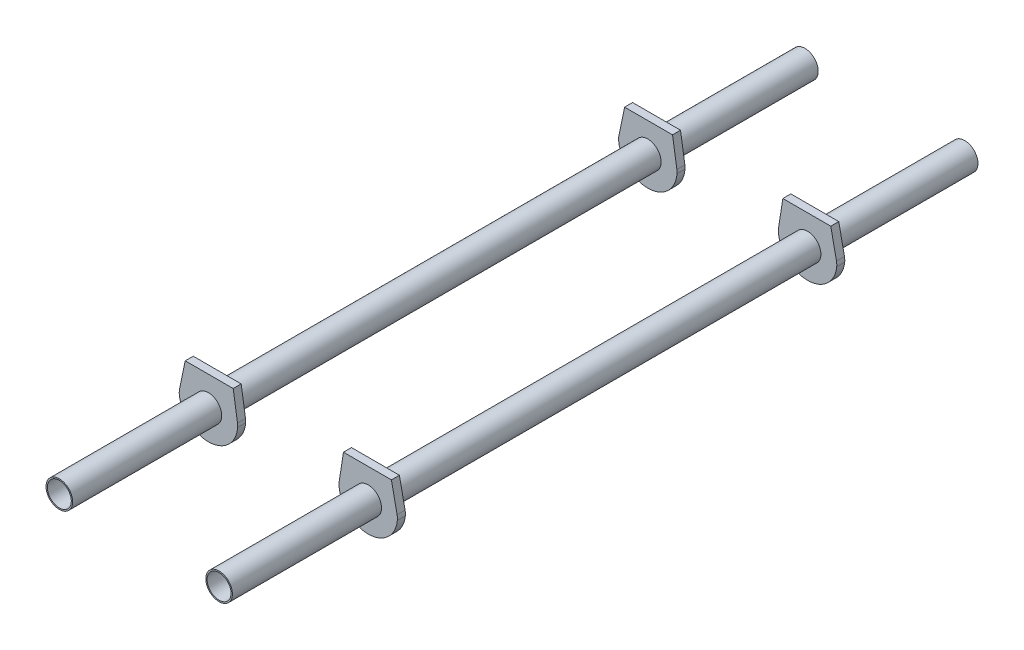
ISO-10303-21;
HEADER;
FILE_DESCRIPTION(('STEP AP214'),'2;1');
FILE_NAME('part.step','',(''),(''),'','','');
FILE_SCHEMA(('AUTOMOTIVE_DESIGN { 1 0 10303 214 1 1 1 1 }'));
ENDSEC;
DATA;
#1=APPLICATION_CONTEXT('core data for automotive mechanical design processes');
#2=APPLICATION_PROTOCOL_DEFINITION('international standard','automotive_design',2000,#1);
#3=PRODUCT_CONTEXT('',#1,'mechanical');
#4=PRODUCT('Part','Part','',(#3));
#5=PRODUCT_RELATED_PRODUCT_CATEGORY('part','',(#4));
#6=PRODUCT_DEFINITION_FORMATION('','',#4);
#7=PRODUCT_DEFINITION_CONTEXT('part definition',#1,'design');
#8=PRODUCT_DEFINITION('design','',#6,#7);
#9=PRODUCT_DEFINITION_SHAPE('','',#8);
#10=(LENGTH_UNIT() NAMED_UNIT(*) SI_UNIT(.MILLI.,.METRE.));
#11=(NAMED_UNIT(*) PLANE_ANGLE_UNIT() SI_UNIT($,.RADIAN.));
#12=(NAMED_UNIT(*) SI_UNIT($,.STERADIAN.) SOLID_ANGLE_UNIT());
#13=UNCERTAINTY_MEASURE_WITH_UNIT(LENGTH_MEASURE(1.E-05),#10,'distance_accuracy_value','');
#14=(GEOMETRIC_REPRESENTATION_CONTEXT(3) GLOBAL_UNCERTAINTY_ASSIGNED_CONTEXT((#13)) GLOBAL_UNIT_ASSIGNED_CONTEXT((#10,
#11,#12)) REPRESENTATION_CONTEXT('',''));
#15=CARTESIAN_POINT('',(0.,0.,0.));
#16=DIRECTION('',(0.,0.,1.));
#17=DIRECTION('',(1.,0.,0.));
#18=AXIS2_PLACEMENT_3D('',#15,#16,#17);
#19=CARTESIAN_POINT('',(-30.,0.,140.));
#20=DIRECTION('',(0.,0.,-1.));
#21=DIRECTION('',(1.,0.,0.));
#22=AXIS2_PLACEMENT_3D('',#19,#20,#21);
#23=CYLINDRICAL_SURFACE('',#22,5.);
#24=CARTESIAN_POINT('',(-30.,0.,-140.));
#25=DIRECTION('',(0.,0.,-1.));
#26=DIRECTION('',(-1.,0.,0.));
#27=AXIS2_PLACEMENT_3D('',#24,#25,#26);
#28=CIRCLE('',#27,5.);
#29=CARTESIAN_POINT('',(-35.,0.,-140.));
#30=VERTEX_POINT('',#29);
#31=EDGE_CURVE('E163',#30,#30,#28,.T.);
#32=ORIENTED_EDGE('',*,*,#31,.F.);
#33=EDGE_LOOP('',(#32));
#34=FACE_BOUND('',#33,.T.);
#35=CARTESIAN_POINT('',(-30.,0.,-84.));
#36=DIRECTION('',(0.,0.,-1.));
#37=DIRECTION('',(-1.,0.,0.));
#38=AXIS2_PLACEMENT_3D('',#35,#36,#37);
#39=CIRCLE('',#38,5.);
#40=CARTESIAN_POINT('',(-35.,0.,-84.));
#41=VERTEX_POINT('',#40);
#42=EDGE_CURVE('E12',#41,#41,#39,.T.);
#43=ORIENTED_EDGE('',*,*,#42,.T.);
#44=EDGE_LOOP('',(#43));
#45=FACE_BOUND('',#44,.T.);
#46=ADVANCED_FACE('F45',(#34,#45),#23,.T.);
#47=CARTESIAN_POINT('',(-30.,0.,140.));
#48=DIRECTION('',(0.,0.,-1.));
#49=DIRECTION('',(-1.,0.,0.));
#50=AXIS2_PLACEMENT_3D('',#47,#48,#49);
#51=CIRCLE('',#50,5.);
#52=CARTESIAN_POINT('',(-35.,0.,140.));
#53=VERTEX_POINT('',#52);
#54=EDGE_CURVE('E166',#53,#53,#51,.T.);
#55=ORIENTED_EDGE('',*,*,#54,.T.);
#56=EDGE_LOOP('',(#55));
#57=FACE_BOUND('',#56,.T.);
#58=CARTESIAN_POINT('',(-30.,0.,84.));
#59=DIRECTION('',(0.,0.,1.));
#60=DIRECTION('',(1.,0.,0.));
#61=AXIS2_PLACEMENT_3D('',#58,#59,#60);
#62=CIRCLE('',#61,5.);
#63=CARTESIAN_POINT('',(-25.,0.,84.));
#64=VERTEX_POINT('',#63);
#65=EDGE_CURVE('E54',#64,#64,#62,.T.);
#66=ORIENTED_EDGE('',*,*,#65,.T.);
#67=EDGE_LOOP('',(#66));
#68=FACE_BOUND('',#67,.T.);
#69=ADVANCED_FACE('F173',(#57,#68),#23,.T.);
#70=CARTESIAN_POINT('',(-30.,0.,140.));
#71=DIRECTION('',(0.,0.,1.));
#72=DIRECTION('',(-1.,0.,0.));
#73=AXIS2_PLACEMENT_3D('',#70,#71,#72);
#74=PLANE('',#73);
#75=ORIENTED_EDGE('',*,*,#54,.F.);
#76=EDGE_LOOP('',(#75));
#77=FACE_BOUND('',#76,.T.);
#78=CARTESIAN_POINT('',(-30.,0.,140.));
#79=DIRECTION('',(0.,0.,-1.));
#80=DIRECTION('',(-1.,0.,0.));
#81=AXIS2_PLACEMENT_3D('',#78,#79,#80);
#82=CIRCLE('',#81,4.5);
#83=CARTESIAN_POINT('',(-34.5,0.,140.));
#84=VERTEX_POINT('',#83);
#85=EDGE_CURVE('E160',#84,#84,#82,.T.);
#86=ORIENTED_EDGE('',*,*,#85,.T.);
#87=EDGE_LOOP('',(#86));
#88=FACE_BOUND('',#87,.T.);
#89=ADVANCED_FACE('F193',(#77,#88),#74,.T.);
#90=CARTESIAN_POINT('',(-30.,0.,-140.));
#91=DIRECTION('',(0.,0.,1.));
#92=DIRECTION('',(-1.,0.,0.));
#93=AXIS2_PLACEMENT_3D('',#90,#91,#92);
#94=PLANE('',#93);
#95=ORIENTED_EDGE('',*,*,#31,.T.);
#96=EDGE_LOOP('',(#95));
#97=FACE_BOUND('',#96,.T.);
#98=CARTESIAN_POINT('',(-30.,0.,-140.));
#99=DIRECTION('',(0.,0.,-1.));
#100=DIRECTION('',(-1.,0.,0.));
#101=AXIS2_PLACEMENT_3D('',#98,#99,#100);
#102=CIRCLE('',#101,4.5);
#103=CARTESIAN_POINT('',(-34.5,0.,-140.));
#104=VERTEX_POINT('',#103);
#105=EDGE_CURVE('E159',#104,#104,#102,.T.);
#106=ORIENTED_EDGE('',*,*,#105,.F.);
#107=EDGE_LOOP('',(#106));
#108=FACE_BOUND('',#107,.T.);
#109=ADVANCED_FACE('F198',(#97,#108),#94,.F.);
#110=CARTESIAN_POINT('',(-30.,0.,-81.));
#111=DIRECTION('',(0.,0.,-1.));
#112=DIRECTION('',(-1.,0.,0.));
#113=AXIS2_PLACEMENT_3D('',#110,#111,#112);
#114=CIRCLE('',#113,5.);
#115=CARTESIAN_POINT('',(-35.,0.,-81.));
#116=VERTEX_POINT('',#115);
#117=EDGE_CURVE('E207',#116,#116,#114,.T.);
#118=ORIENTED_EDGE('',*,*,#117,.F.);
#119=EDGE_LOOP('',(#118));
#120=FACE_BOUND('',#119,.T.);
#121=CARTESIAN_POINT('',(-30.,0.,81.));
#122=DIRECTION('',(0.,0.,-1.));
#123=DIRECTION('',(-1.,0.,0.));
#124=AXIS2_PLACEMENT_3D('',#121,#122,#123);
#125=CIRCLE('',#124,5.);
#126=CARTESIAN_POINT('',(-35.,0.,81.));
#127=VERTEX_POINT('',#126);
#128=EDGE_CURVE('E141',#127,#127,#125,.T.);
#129=ORIENTED_EDGE('',*,*,#128,.T.);
#130=EDGE_LOOP('',(#129));
#131=FACE_BOUND('',#130,.T.);
#132=ADVANCED_FACE('F47',(#120,#131),#23,.T.);
#133=CARTESIAN_POINT('',(-30.,0.,140.));
#134=DIRECTION('',(0.,0.,-1.));
#135=DIRECTION('',(1.,0.,0.));
#136=AXIS2_PLACEMENT_3D('',#133,#134,#135);
#137=CYLINDRICAL_SURFACE('',#136,4.5);
#138=ORIENTED_EDGE('',*,*,#85,.F.);
#139=EDGE_LOOP('',(#138));
#140=FACE_BOUND('',#139,.T.);
#141=ORIENTED_EDGE('',*,*,#105,.T.);
#142=EDGE_LOOP('',(#141));
#143=FACE_BOUND('',#142,.T.);
#144=ADVANCED_FACE('F176',(#140,#143),#137,.F.);
#145=CARTESIAN_POINT('',(-34.9751476146063,-0.497901810478293,84.));
#146=DIRECTION('',(0.,0.,-1.));
#147=DIRECTION('',(1.,0.,0.));
#148=AXIS2_PLACEMENT_3D('',#145,#146,#147);
#149=PLANE('',#148);
#150=DIRECTION('',(1.,0.,0.));
#151=VECTOR('',#150,1.);
#152=CARTESIAN_POINT('',(-20.7120270214792,11.,84.));
#153=LINE('',#152,#151);
#154=CARTESIAN_POINT('',(-38.7120270214792,11.,84.));
#155=VERTEX_POINT('',#154);
#156=CARTESIAN_POINT('',(-20.7120270214792,11.,84.));
#157=VERTEX_POINT('',#156);
#158=EDGE_CURVE('E152',#155,#157,#153,.T.);
#159=ORIENTED_EDGE('',*,*,#158,.F.);
#160=DIRECTION('',(0.203639165132571,0.979046010371377,0.));
#161=VECTOR('',#160,1.);
#162=CARTESIAN_POINT('',(-38.7120270214792,11.,84.));
#163=LINE('',#162,#161);
#164=CARTESIAN_POINT('',(-40.8494236768345,0.723933180317131,84.));
#165=VERTEX_POINT('',#164);
#166=EDGE_CURVE('E132',#165,#155,#163,.T.);
#167=ORIENTED_EDGE('',*,*,#166,.F.);
#168=CARTESIAN_POINT('',(-34.9751476146063,-0.497901810478293,84.));
#169=DIRECTION('',(0.,0.,-1.));
#170=DIRECTION('',(1.,0.,0.));
#171=AXIS2_PLACEMENT_3D('',#168,#169,#170);
#172=CIRCLE('',#171,6.);
#173=CARTESIAN_POINT('',(-40.9453247521338,-1.09538398305225,84.));
#174=VERTEX_POINT('',#173);
#175=EDGE_CURVE('E112',#174,#165,#172,.T.);
#176=ORIENTED_EDGE('',*,*,#175,.F.);
#177=CARTESIAN_POINT('',(-30.,0.,84.));
#178=DIRECTION('',(0.,0.,-1.));
#179=DIRECTION('',(-1.,0.,0.));
#180=AXIS2_PLACEMENT_3D('',#177,#178,#179);
#181=CIRCLE('',#180,11.);
#182=CARTESIAN_POINT('',(-19.0308297352209,-0.822984630649349,84.));
#183=VERTEX_POINT('',#182);
#184=EDGE_CURVE('E122',#183,#174,#181,.T.);
#185=ORIENTED_EDGE('',*,*,#184,.F.);
#186=CARTESIAN_POINT('',(-25.0140135160095,-0.374083923022432,84.));
#187=DIRECTION('',(0.,0.,-1.));
#188=DIRECTION('',(-1.,0.,0.));
#189=AXIS2_PLACEMENT_3D('',#186,#187,#188);
#190=CIRCLE('',#189,6.);
#191=CARTESIAN_POINT('',(-19.0853896967876,0.548640093222408,84.));
#192=VERTEX_POINT('',#191);
#193=EDGE_CURVE('E127',#192,#183,#190,.T.);
#194=ORIENTED_EDGE('',*,*,#193,.F.);
#195=DIRECTION('',(0.153787336040807,-0.988103969870313,0.));
#196=VECTOR('',#195,1.);
#197=CARTESIAN_POINT('',(-19.0853896967876,0.548640093222408,84.));
#198=LINE('',#197,#196);
#199=EDGE_CURVE('E219',#157,#192,#198,.T.);
#200=ORIENTED_EDGE('',*,*,#199,.F.);
#201=EDGE_LOOP('',(#159,#167,#176,#185,#194,#200));
#202=FACE_BOUND('',#201,.T.);
#203=ORIENTED_EDGE('',*,*,#65,.F.);
#204=EDGE_LOOP('',(#203));
#205=FACE_BOUND('',#204,.T.);
#206=ADVANCED_FACE('F130',(#202,#205),#149,.F.);
#207=CARTESIAN_POINT('',(-34.9751476146063,-0.497901810478293,81.));
#208=DIRECTION('',(0.,0.,-1.));
#209=DIRECTION('',(1.,0.,0.));
#210=AXIS2_PLACEMENT_3D('',#207,#208,#209);
#211=PLANE('',#210);
#212=DIRECTION('',(1.,0.,0.));
#213=VECTOR('',#212,1.);
#214=CARTESIAN_POINT('',(-20.7120270214792,11.,81.));
#215=LINE('',#214,#213);
#216=CARTESIAN_POINT('',(-38.7120270214792,11.,81.));
#217=VERTEX_POINT('',#216);
#218=CARTESIAN_POINT('',(-20.7120270214792,11.,81.));
#219=VERTEX_POINT('',#218);
#220=EDGE_CURVE('E137',#217,#219,#215,.T.);
#221=ORIENTED_EDGE('',*,*,#220,.T.);
#222=DIRECTION('',(0.153787336040807,-0.988103969870313,0.));
#223=VECTOR('',#222,1.);
#224=CARTESIAN_POINT('',(-19.0853896967876,0.548640093222408,81.));
#225=LINE('',#224,#223);
#226=CARTESIAN_POINT('',(-19.0853896967876,0.548640093222408,81.));
#227=VERTEX_POINT('',#226);
#228=EDGE_CURVE('E140',#219,#227,#225,.T.);
#229=ORIENTED_EDGE('',*,*,#228,.T.);
#230=CARTESIAN_POINT('',(-25.0140135160095,-0.374083923022432,81.));
#231=DIRECTION('',(0.,0.,-1.));
#232=DIRECTION('',(-1.,0.,0.));
#233=AXIS2_PLACEMENT_3D('',#230,#231,#232);
#234=CIRCLE('',#233,6.);
#235=CARTESIAN_POINT('',(-19.0308297352209,-0.822984630649349,81.));
#236=VERTEX_POINT('',#235);
#237=EDGE_CURVE('E144',#227,#236,#234,.T.);
#238=ORIENTED_EDGE('',*,*,#237,.T.);
#239=CARTESIAN_POINT('',(-30.,0.,81.));
#240=DIRECTION('',(0.,0.,-1.));
#241=DIRECTION('',(-1.,0.,0.));
#242=AXIS2_PLACEMENT_3D('',#239,#240,#241);
#243=CIRCLE('',#242,11.);
#244=CARTESIAN_POINT('',(-40.9453247521338,-1.09538398305225,81.));
#245=VERTEX_POINT('',#244);
#246=EDGE_CURVE('E147',#236,#245,#243,.T.);
#247=ORIENTED_EDGE('',*,*,#246,.T.);
#248=CARTESIAN_POINT('',(-34.9751476146063,-0.497901810478293,81.));
#249=DIRECTION('',(0.,0.,-1.));
#250=DIRECTION('',(1.,0.,0.));
#251=AXIS2_PLACEMENT_3D('',#248,#249,#250);
#252=CIRCLE('',#251,6.);
#253=CARTESIAN_POINT('',(-40.8494236768345,0.723933180317131,81.));
#254=VERTEX_POINT('',#253);
#255=EDGE_CURVE('E115',#245,#254,#252,.T.);
#256=ORIENTED_EDGE('',*,*,#255,.T.);
#257=DIRECTION('',(0.203639165132571,0.979046010371377,0.));
#258=VECTOR('',#257,1.);
#259=CARTESIAN_POINT('',(-38.7120270214792,11.,81.));
#260=LINE('',#259,#258);
#261=EDGE_CURVE('E150',#254,#217,#260,.T.);
#262=ORIENTED_EDGE('',*,*,#261,.T.);
#263=EDGE_LOOP('',(#221,#229,#238,#247,#256,#262));
#264=FACE_BOUND('',#263,.T.);
#265=ORIENTED_EDGE('',*,*,#128,.F.);
#266=EDGE_LOOP('',(#265));
#267=FACE_BOUND('',#266,.T.);
#268=ADVANCED_FACE('F175',(#264,#267),#211,.T.);
#269=CARTESIAN_POINT('',(-20.7120270214792,11.,84.));
#270=DIRECTION('',(0.,-1.,0.));
#271=DIRECTION('',(0.,0.,-1.));
#272=AXIS2_PLACEMENT_3D('',#269,#270,#271);
#273=PLANE('',#272);
#274=ORIENTED_EDGE('',*,*,#220,.F.);
#275=DIRECTION('',(0.,0.,-1.));
#276=VECTOR('',#275,1.);
#277=CARTESIAN_POINT('',(-38.7120270214792,11.,84.));
#278=LINE('',#277,#276);
#279=EDGE_CURVE('E62',#155,#217,#278,.T.);
#280=ORIENTED_EDGE('',*,*,#279,.F.);
#281=ORIENTED_EDGE('',*,*,#158,.T.);
#282=DIRECTION('',(0.,0.,-1.));
#283=VECTOR('',#282,1.);
#284=CARTESIAN_POINT('',(-20.7120270214792,11.,84.));
#285=LINE('',#284,#283);
#286=EDGE_CURVE('E97',#157,#219,#285,.T.);
#287=ORIENTED_EDGE('',*,*,#286,.T.);
#288=EDGE_LOOP('',(#274,#280,#281,#287));
#289=FACE_BOUND('',#288,.T.);
#290=ADVANCED_FACE('F182',(#289),#273,.F.);
#291=CARTESIAN_POINT('',(-19.0853896967876,0.548640093222408,84.));
#292=DIRECTION('',(-0.988103969870313,-0.153787336040807,0.));
#293=DIRECTION('',(-0.153787336040807,0.988103969870313,0.));
#294=AXIS2_PLACEMENT_3D('',#291,#292,#293);
#295=PLANE('',#294);
#296=ORIENTED_EDGE('',*,*,#228,.F.);
#297=ORIENTED_EDGE('',*,*,#286,.F.);
#298=ORIENTED_EDGE('',*,*,#199,.T.);
#299=DIRECTION('',(0.,0.,-1.));
#300=VECTOR('',#299,1.);
#301=CARTESIAN_POINT('',(-19.0853896967876,0.548640093222408,84.));
#302=LINE('',#301,#300);
#303=EDGE_CURVE('E156',#192,#227,#302,.T.);
#304=ORIENTED_EDGE('',*,*,#303,.T.);
#305=EDGE_LOOP('',(#296,#297,#298,#304));
#306=FACE_BOUND('',#305,.T.);
#307=ADVANCED_FACE('F223',(#306),#295,.F.);
#308=CARTESIAN_POINT('',(-25.0140135160095,-0.374083923022432,84.));
#309=DIRECTION('',(0.,0.,-1.));
#310=DIRECTION('',(1.,0.,0.));
#311=AXIS2_PLACEMENT_3D('',#308,#309,#310);
#312=CYLINDRICAL_SURFACE('',#311,6.);
#313=ORIENTED_EDGE('',*,*,#237,.F.);
#314=ORIENTED_EDGE('',*,*,#303,.F.);
#315=ORIENTED_EDGE('',*,*,#193,.T.);
#316=DIRECTION('',(0.,0.,-1.));
#317=VECTOR('',#316,1.);
#318=CARTESIAN_POINT('',(-19.0308297352209,-0.822984630649349,84.));
#319=LINE('',#318,#317);
#320=EDGE_CURVE('E119',#183,#236,#319,.T.);
#321=ORIENTED_EDGE('',*,*,#320,.T.);
#322=EDGE_LOOP('',(#313,#314,#315,#321));
#323=FACE_BOUND('',#322,.T.);
#324=ADVANCED_FACE('F222',(#323),#312,.T.);
#325=CARTESIAN_POINT('',(-30.,0.,84.));
#326=DIRECTION('',(0.,0.,-1.));
#327=DIRECTION('',(1.,0.,0.));
#328=AXIS2_PLACEMENT_3D('',#325,#326,#327);
#329=CYLINDRICAL_SURFACE('',#328,11.);
#330=ORIENTED_EDGE('',*,*,#246,.F.);
#331=ORIENTED_EDGE('',*,*,#320,.F.);
#332=ORIENTED_EDGE('',*,*,#184,.T.);
#333=DIRECTION('',(0.,0.,-1.));
#334=VECTOR('',#333,1.);
#335=CARTESIAN_POINT('',(-40.9453247521338,-1.09538398305225,84.));
#336=LINE('',#335,#334);
#337=EDGE_CURVE('E108',#174,#245,#336,.T.);
#338=ORIENTED_EDGE('',*,*,#337,.T.);
#339=EDGE_LOOP('',(#330,#331,#332,#338));
#340=FACE_BOUND('',#339,.T.);
#341=ADVANCED_FACE('F123',(#340),#329,.T.);
#342=CARTESIAN_POINT('',(-34.9751476146063,-0.497901810478293,84.));
#343=DIRECTION('',(0.,0.,-1.));
#344=DIRECTION('',(1.,0.,0.));
#345=AXIS2_PLACEMENT_3D('',#342,#343,#344);
#346=CYLINDRICAL_SURFACE('',#345,6.);
#347=ORIENTED_EDGE('',*,*,#255,.F.);
#348=ORIENTED_EDGE('',*,*,#337,.F.);
#349=ORIENTED_EDGE('',*,*,#175,.T.);
#350=DIRECTION('',(0.,0.,-1.));
#351=VECTOR('',#350,1.);
#352=CARTESIAN_POINT('',(-40.8494236768345,0.723933180317131,84.));
#353=LINE('',#352,#351);
#354=EDGE_CURVE('E86',#165,#254,#353,.T.);
#355=ORIENTED_EDGE('',*,*,#354,.T.);
#356=EDGE_LOOP('',(#347,#348,#349,#355));
#357=FACE_BOUND('',#356,.T.);
#358=ADVANCED_FACE('F110',(#357),#346,.T.);
#359=CARTESIAN_POINT('',(-38.7120270214792,11.,84.));
#360=DIRECTION('',(0.979046010371377,-0.20363916513257,0.));
#361=DIRECTION('',(-0.203639165132571,-0.979046010371377,0.));
#362=AXIS2_PLACEMENT_3D('',#359,#360,#361);
#363=PLANE('',#362);
#364=ORIENTED_EDGE('',*,*,#261,.F.);
#365=ORIENTED_EDGE('',*,*,#354,.F.);
#366=ORIENTED_EDGE('',*,*,#166,.T.);
#367=ORIENTED_EDGE('',*,*,#279,.T.);
#368=EDGE_LOOP('',(#364,#365,#366,#367));
#369=FACE_BOUND('',#368,.T.);
#370=ADVANCED_FACE('F224',(#369),#363,.F.);
#371=CARTESIAN_POINT('',(-34.9751476146063,-0.497901810478293,-84.));
#372=DIRECTION('',(0.,0.,1.));
#373=DIRECTION('',(1.,0.,0.));
#374=AXIS2_PLACEMENT_3D('',#371,#372,#373);
#375=PLANE('',#374);
#376=DIRECTION('',(1.,0.,0.));
#377=VECTOR('',#376,1.);
#378=CARTESIAN_POINT('',(-20.7120270214792,11.,-84.));
#379=LINE('',#378,#377);
#380=CARTESIAN_POINT('',(-38.7120270214792,11.,-84.));
#381=VERTEX_POINT('',#380);
#382=CARTESIAN_POINT('',(-20.7120270214792,11.,-84.));
#383=VERTEX_POINT('',#382);
#384=EDGE_CURVE('E415',#381,#383,#379,.T.);
#385=ORIENTED_EDGE('',*,*,#384,.T.);
#386=DIRECTION('',(0.153787336040807,-0.988103969870313,0.));
#387=VECTOR('',#386,1.);
#388=CARTESIAN_POINT('',(-19.0853896967876,0.548640093222408,-84.));
#389=LINE('',#388,#387);
#390=CARTESIAN_POINT('',(-19.0853896967876,0.548640093222408,-84.));
#391=VERTEX_POINT('',#390);
#392=EDGE_CURVE('E479',#383,#391,#389,.T.);
#393=ORIENTED_EDGE('',*,*,#392,.T.);
#394=CARTESIAN_POINT('',(-25.0140135160095,-0.374083923022432,-84.));
#395=DIRECTION('',(0.,0.,-1.));
#396=DIRECTION('',(-1.,0.,0.));
#397=AXIS2_PLACEMENT_3D('',#394,#395,#396);
#398=CIRCLE('',#397,6.);
#399=CARTESIAN_POINT('',(-19.0308297352209,-0.822984630649349,-84.));
#400=VERTEX_POINT('',#399);
#401=EDGE_CURVE('E457',#391,#400,#398,.T.);
#402=ORIENTED_EDGE('',*,*,#401,.T.);
#403=CARTESIAN_POINT('',(-30.,0.,-84.));
#404=DIRECTION('',(0.,0.,-1.));
#405=DIRECTION('',(-1.,0.,0.));
#406=AXIS2_PLACEMENT_3D('',#403,#404,#405);
#407=CIRCLE('',#406,11.);
#408=CARTESIAN_POINT('',(-40.9453247521338,-1.09538398305225,-84.));
#409=VERTEX_POINT('',#408);
#410=EDGE_CURVE('E486',#400,#409,#407,.T.);
#411=ORIENTED_EDGE('',*,*,#410,.T.);
#412=CARTESIAN_POINT('',(-34.9751476146063,-0.497901810478293,-84.));
#413=DIRECTION('',(0.,0.,-1.));
#414=DIRECTION('',(1.,0.,0.));
#415=AXIS2_PLACEMENT_3D('',#412,#413,#414);
#416=CIRCLE('',#415,6.);
#417=CARTESIAN_POINT('',(-40.8494236768345,0.723933180317131,-84.));
#418=VERTEX_POINT('',#417);
#419=EDGE_CURVE('E488',#409,#418,#416,.T.);
#420=ORIENTED_EDGE('',*,*,#419,.T.);
#421=DIRECTION('',(0.203639165132571,0.979046010371377,0.));
#422=VECTOR('',#421,1.);
#423=CARTESIAN_POINT('',(-38.7120270214792,11.,-84.));
#424=LINE('',#423,#422);
#425=EDGE_CURVE('E432',#418,#381,#424,.T.);
#426=ORIENTED_EDGE('',*,*,#425,.T.);
#427=EDGE_LOOP('',(#385,#393,#402,#411,#420,#426));
#428=FACE_BOUND('',#427,.T.);
#429=ORIENTED_EDGE('',*,*,#42,.F.);
#430=EDGE_LOOP('',(#429));
#431=FACE_BOUND('',#430,.T.);
#432=ADVANCED_FACE('F226',(#428,#431),#375,.F.);
#433=CARTESIAN_POINT('',(-34.9751476146063,-0.497901810478293,-81.));
#434=DIRECTION('',(0.,0.,1.));
#435=DIRECTION('',(1.,0.,0.));
#436=AXIS2_PLACEMENT_3D('',#433,#434,#435);
#437=PLANE('',#436);
#438=DIRECTION('',(1.,0.,0.));
#439=VECTOR('',#438,1.);
#440=CARTESIAN_POINT('',(-20.7120270214792,11.,-81.));
#441=LINE('',#440,#439);
#442=CARTESIAN_POINT('',(-38.7120270214792,11.,-81.));
#443=VERTEX_POINT('',#442);
#444=CARTESIAN_POINT('',(-20.7120270214792,11.,-81.));
#445=VERTEX_POINT('',#444);
#446=EDGE_CURVE('E420',#443,#445,#441,.T.);
#447=ORIENTED_EDGE('',*,*,#446,.F.);
#448=DIRECTION('',(0.203639165132571,0.979046010371377,0.));
#449=VECTOR('',#448,1.);
#450=CARTESIAN_POINT('',(-38.7120270214792,11.,-81.));
#451=LINE('',#450,#449);
#452=CARTESIAN_POINT('',(-40.8494236768345,0.723933180317131,-81.));
#453=VERTEX_POINT('',#452);
#454=EDGE_CURVE('E403',#453,#443,#451,.T.);
#455=ORIENTED_EDGE('',*,*,#454,.F.);
#456=CARTESIAN_POINT('',(-34.9751476146063,-0.497901810478293,-81.));
#457=DIRECTION('',(0.,0.,-1.));
#458=DIRECTION('',(1.,0.,0.));
#459=AXIS2_PLACEMENT_3D('',#456,#457,#458);
#460=CIRCLE('',#459,6.);
#461=CARTESIAN_POINT('',(-40.9453247521338,-1.09538398305225,-81.));
#462=VERTEX_POINT('',#461);
#463=EDGE_CURVE('E416',#462,#453,#460,.T.);
#464=ORIENTED_EDGE('',*,*,#463,.F.);
#465=CARTESIAN_POINT('',(-30.,0.,-81.));
#466=DIRECTION('',(0.,0.,-1.));
#467=DIRECTION('',(-1.,0.,0.));
#468=AXIS2_PLACEMENT_3D('',#465,#466,#467);
#469=CIRCLE('',#468,11.);
#470=CARTESIAN_POINT('',(-19.0308297352209,-0.822984630649349,-81.));
#471=VERTEX_POINT('',#470);
#472=EDGE_CURVE('E437',#471,#462,#469,.T.);
#473=ORIENTED_EDGE('',*,*,#472,.F.);
#474=CARTESIAN_POINT('',(-25.0140135160095,-0.374083923022432,-81.));
#475=DIRECTION('',(0.,0.,-1.));
#476=DIRECTION('',(-1.,0.,0.));
#477=AXIS2_PLACEMENT_3D('',#474,#475,#476);
#478=CIRCLE('',#477,6.);
#479=CARTESIAN_POINT('',(-19.0853896967876,0.548640093222408,-81.));
#480=VERTEX_POINT('',#479);
#481=EDGE_CURVE('E428',#480,#471,#478,.T.);
#482=ORIENTED_EDGE('',*,*,#481,.F.);
#483=DIRECTION('',(0.153787336040807,-0.988103969870313,0.));
#484=VECTOR('',#483,1.);
#485=CARTESIAN_POINT('',(-19.0853896967876,0.548640093222408,-81.));
#486=LINE('',#485,#484);
#487=EDGE_CURVE('E425',#445,#480,#486,.T.);
#488=ORIENTED_EDGE('',*,*,#487,.F.);
#489=EDGE_LOOP('',(#447,#455,#464,#473,#482,#488));
#490=FACE_BOUND('',#489,.T.);
#491=ORIENTED_EDGE('',*,*,#117,.T.);
#492=EDGE_LOOP('',(#491));
#493=FACE_BOUND('',#492,.T.);
#494=ADVANCED_FACE('F232',(#490,#493),#437,.T.);
#495=CARTESIAN_POINT('',(-20.7120270214792,11.,-84.));
#496=DIRECTION('',(0.,-1.,0.));
#497=DIRECTION('',(0.,0.,1.));
#498=AXIS2_PLACEMENT_3D('',#495,#496,#497);
#499=PLANE('',#498);
#500=ORIENTED_EDGE('',*,*,#446,.T.);
#501=DIRECTION('',(0.,0.,1.));
#502=VECTOR('',#501,1.);
#503=CARTESIAN_POINT('',(-20.7120270214792,11.,-84.));
#504=LINE('',#503,#502);
#505=EDGE_CURVE('E211',#383,#445,#504,.T.);
#506=ORIENTED_EDGE('',*,*,#505,.F.);
#507=ORIENTED_EDGE('',*,*,#384,.F.);
#508=DIRECTION('',(0.,0.,1.));
#509=VECTOR('',#508,1.);
#510=CARTESIAN_POINT('',(-38.7120270214792,11.,-84.));
#511=LINE('',#510,#509);
#512=EDGE_CURVE('E407',#381,#443,#511,.T.);
#513=ORIENTED_EDGE('',*,*,#512,.T.);
#514=EDGE_LOOP('',(#500,#506,#507,#513));
#515=FACE_BOUND('',#514,.T.);
#516=ADVANCED_FACE('F336',(#515),#499,.F.);
#517=CARTESIAN_POINT('',(-19.0853896967876,0.548640093222408,-84.));
#518=DIRECTION('',(-0.988103969870313,-0.153787336040807,0.));
#519=DIRECTION('',(-0.153787336040807,0.988103969870313,0.));
#520=AXIS2_PLACEMENT_3D('',#517,#518,#519);
#521=PLANE('',#520);
#522=ORIENTED_EDGE('',*,*,#487,.T.);
#523=DIRECTION('',(0.,0.,1.));
#524=VECTOR('',#523,1.);
#525=CARTESIAN_POINT('',(-19.0853896967876,0.548640093222408,-84.));
#526=LINE('',#525,#524);
#527=EDGE_CURVE('E214',#391,#480,#526,.T.);
#528=ORIENTED_EDGE('',*,*,#527,.F.);
#529=ORIENTED_EDGE('',*,*,#392,.F.);
#530=ORIENTED_EDGE('',*,*,#505,.T.);
#531=EDGE_LOOP('',(#522,#528,#529,#530));
#532=FACE_BOUND('',#531,.T.);
#533=ADVANCED_FACE('F345',(#532),#521,.F.);
#534=CARTESIAN_POINT('',(-25.0140135160095,-0.374083923022432,-84.));
#535=DIRECTION('',(0.,0.,1.));
#536=DIRECTION('',(1.,0.,0.));
#537=AXIS2_PLACEMENT_3D('',#534,#535,#536);
#538=CYLINDRICAL_SURFACE('',#537,6.);
#539=ORIENTED_EDGE('',*,*,#481,.T.);
#540=DIRECTION('',(0.,0.,1.));
#541=VECTOR('',#540,1.);
#542=CARTESIAN_POINT('',(-19.0308297352209,-0.822984630649349,-84.));
#543=LINE('',#542,#541);
#544=EDGE_CURVE('E446',#400,#471,#543,.T.);
#545=ORIENTED_EDGE('',*,*,#544,.F.);
#546=ORIENTED_EDGE('',*,*,#401,.F.);
#547=ORIENTED_EDGE('',*,*,#527,.T.);
#548=EDGE_LOOP('',(#539,#545,#546,#547));
#549=FACE_BOUND('',#548,.T.);
#550=ADVANCED_FACE('F353',(#549),#538,.T.);
#551=CARTESIAN_POINT('',(-30.,0.,-84.));
#552=DIRECTION('',(0.,0.,1.));
#553=DIRECTION('',(1.,0.,0.));
#554=AXIS2_PLACEMENT_3D('',#551,#552,#553);
#555=CYLINDRICAL_SURFACE('',#554,11.);
#556=ORIENTED_EDGE('',*,*,#472,.T.);
#557=DIRECTION('',(0.,0.,1.));
#558=VECTOR('',#557,1.);
#559=CARTESIAN_POINT('',(-40.9453247521338,-1.09538398305225,-84.));
#560=LINE('',#559,#558);
#561=EDGE_CURVE('E443',#409,#462,#560,.T.);
#562=ORIENTED_EDGE('',*,*,#561,.F.);
#563=ORIENTED_EDGE('',*,*,#410,.F.);
#564=ORIENTED_EDGE('',*,*,#544,.T.);
#565=EDGE_LOOP('',(#556,#562,#563,#564));
#566=FACE_BOUND('',#565,.T.);
#567=ADVANCED_FACE('F362',(#566),#555,.T.);
#568=CARTESIAN_POINT('',(-34.9751476146063,-0.497901810478293,-84.));
#569=DIRECTION('',(0.,0.,1.));
#570=DIRECTION('',(1.,0.,0.));
#571=AXIS2_PLACEMENT_3D('',#568,#569,#570);
#572=CYLINDRICAL_SURFACE('',#571,6.);
#573=ORIENTED_EDGE('',*,*,#463,.T.);
#574=DIRECTION('',(0.,0.,1.));
#575=VECTOR('',#574,1.);
#576=CARTESIAN_POINT('',(-40.8494236768345,0.723933180317131,-84.));
#577=LINE('',#576,#575);
#578=EDGE_CURVE('E411',#418,#453,#577,.T.);
#579=ORIENTED_EDGE('',*,*,#578,.F.);
#580=ORIENTED_EDGE('',*,*,#419,.F.);
#581=ORIENTED_EDGE('',*,*,#561,.T.);
#582=EDGE_LOOP('',(#573,#579,#580,#581));
#583=FACE_BOUND('',#582,.T.);
#584=ADVANCED_FACE('F371',(#583),#572,.T.);
#585=CARTESIAN_POINT('',(-38.7120270214792,11.,-84.));
#586=DIRECTION('',(0.979046010371377,-0.20363916513257,0.));
#587=DIRECTION('',(-0.203639165132571,-0.979046010371377,0.));
#588=AXIS2_PLACEMENT_3D('',#585,#586,#587);
#589=PLANE('',#588);
#590=ORIENTED_EDGE('',*,*,#454,.T.);
#591=ORIENTED_EDGE('',*,*,#512,.F.);
#592=ORIENTED_EDGE('',*,*,#425,.F.);
#593=ORIENTED_EDGE('',*,*,#578,.T.);
#594=EDGE_LOOP('',(#590,#591,#592,#593));
#595=FACE_BOUND('',#594,.T.);
#596=ADVANCED_FACE('F380',(#595),#589,.F.);
#597=CLOSED_SHELL('',(#46,#69,#89,#109,#132,#144,#206,#268,#290,#307,#324,#341,#358,#370,#432,
#494,#516,#533,#550,#567,#584,#596));
#598=MANIFOLD_SOLID_BREP('B2',#597);
#599=CARTESIAN_POINT('',(30.,0.,140.));
#600=DIRECTION('',(0.,0.,-1.));
#601=DIRECTION('',(-1.,0.,0.));
#602=AXIS2_PLACEMENT_3D('',#599,#600,#601);
#603=CYLINDRICAL_SURFACE('',#602,5.);
#604=CARTESIAN_POINT('',(30.,0.,-140.));
#605=DIRECTION('',(0.,0.,1.));
#606=DIRECTION('',(1.,0.,0.));
#607=AXIS2_PLACEMENT_3D('',#604,#605,#606);
#608=CIRCLE('',#607,5.);
#609=CARTESIAN_POINT('',(35.,0.,-140.));
#610=VERTEX_POINT('',#609);
#611=EDGE_CURVE('E640',#610,#610,#608,.T.);
#612=ORIENTED_EDGE('',*,*,#611,.T.);
#613=EDGE_LOOP('',(#612));
#614=FACE_BOUND('',#613,.T.);
#615=CARTESIAN_POINT('',(30.,0.,-84.));
#616=DIRECTION('',(0.,0.,1.));
#617=DIRECTION('',(1.,0.,0.));
#618=AXIS2_PLACEMENT_3D('',#615,#616,#617);
#619=CIRCLE('',#618,5.);
#620=CARTESIAN_POINT('',(35.,0.,-84.));
#621=VERTEX_POINT('',#620);
#622=EDGE_CURVE('E43',#621,#621,#619,.T.);
#623=ORIENTED_EDGE('',*,*,#622,.F.);
#624=EDGE_LOOP('',(#623));
#625=FACE_BOUND('',#624,.T.);
#626=ADVANCED_FACE('F525',(#614,#625),#603,.T.);
#627=CARTESIAN_POINT('',(30.,0.,140.));
#628=DIRECTION('',(0.,0.,1.));
#629=DIRECTION('',(1.,0.,0.));
#630=AXIS2_PLACEMENT_3D('',#627,#628,#629);
#631=CIRCLE('',#630,5.);
#632=CARTESIAN_POINT('',(35.,0.,140.));
#633=VERTEX_POINT('',#632);
#634=EDGE_CURVE('E643',#633,#633,#631,.T.);
#635=ORIENTED_EDGE('',*,*,#634,.F.);
#636=EDGE_LOOP('',(#635));
#637=FACE_BOUND('',#636,.T.);
#638=CARTESIAN_POINT('',(30.,0.,84.));
#639=DIRECTION('',(0.,0.,-1.));
#640=DIRECTION('',(-1.,0.,0.));
#641=AXIS2_PLACEMENT_3D('',#638,#639,#640);
#642=CIRCLE('',#641,5.);
#643=CARTESIAN_POINT('',(25.,0.,84.));
#644=VERTEX_POINT('',#643);
#645=EDGE_CURVE('E534',#644,#644,#642,.T.);
#646=ORIENTED_EDGE('',*,*,#645,.F.);
#647=EDGE_LOOP('',(#646));
#648=FACE_BOUND('',#647,.T.);
#649=ADVANCED_FACE('F650',(#637,#648),#603,.T.);
#650=CARTESIAN_POINT('',(30.,0.,140.));
#651=DIRECTION('',(0.,0.,1.));
#652=DIRECTION('',(1.,0.,0.));
#653=AXIS2_PLACEMENT_3D('',#650,#651,#652);
#654=PLANE('',#653);
#655=ORIENTED_EDGE('',*,*,#634,.T.);
#656=EDGE_LOOP('',(#655));
#657=FACE_BOUND('',#656,.T.);
#658=CARTESIAN_POINT('',(30.,0.,140.));
#659=DIRECTION('',(0.,0.,1.));
#660=DIRECTION('',(1.,0.,0.));
#661=AXIS2_PLACEMENT_3D('',#658,#659,#660);
#662=CIRCLE('',#661,4.5);
#663=CARTESIAN_POINT('',(34.5,0.,140.));
#664=VERTEX_POINT('',#663);
#665=EDGE_CURVE('E637',#664,#664,#662,.T.);
#666=ORIENTED_EDGE('',*,*,#665,.F.);
#667=EDGE_LOOP('',(#666));
#668=FACE_BOUND('',#667,.T.);
#669=ADVANCED_FACE('F652',(#657,#668),#654,.T.);
#670=CARTESIAN_POINT('',(30.,0.,-140.));
#671=DIRECTION('',(0.,0.,1.));
#672=DIRECTION('',(1.,0.,0.));
#673=AXIS2_PLACEMENT_3D('',#670,#671,#672);
#674=PLANE('',#673);
#675=ORIENTED_EDGE('',*,*,#611,.F.);
#676=EDGE_LOOP('',(#675));
#677=FACE_BOUND('',#676,.T.);
#678=CARTESIAN_POINT('',(30.,0.,-140.));
#679=DIRECTION('',(0.,0.,1.));
#680=DIRECTION('',(1.,0.,0.));
#681=AXIS2_PLACEMENT_3D('',#678,#679,#680);
#682=CIRCLE('',#681,4.5);
#683=CARTESIAN_POINT('',(34.5,0.,-140.));
#684=VERTEX_POINT('',#683);
#685=EDGE_CURVE('E636',#684,#684,#682,.T.);
#686=ORIENTED_EDGE('',*,*,#685,.T.);
#687=EDGE_LOOP('',(#686));
#688=FACE_BOUND('',#687,.T.);
#689=ADVANCED_FACE('F658',(#677,#688),#674,.F.);
#690=CARTESIAN_POINT('',(30.,0.,-81.));
#691=DIRECTION('',(0.,0.,1.));
#692=DIRECTION('',(1.,0.,0.));
#693=AXIS2_PLACEMENT_3D('',#690,#691,#692);
#694=CIRCLE('',#693,5.);
#695=CARTESIAN_POINT('',(35.,0.,-81.));
#696=VERTEX_POINT('',#695);
#697=EDGE_CURVE('E676',#696,#696,#694,.T.);
#698=ORIENTED_EDGE('',*,*,#697,.T.);
#699=EDGE_LOOP('',(#698));
#700=FACE_BOUND('',#699,.T.);
#701=CARTESIAN_POINT('',(30.,0.,81.));
#702=DIRECTION('',(0.,0.,1.));
#703=DIRECTION('',(1.,0.,0.));
#704=AXIS2_PLACEMENT_3D('',#701,#702,#703);
#705=CIRCLE('',#704,5.);
#706=CARTESIAN_POINT('',(35.,0.,81.));
#707=VERTEX_POINT('',#706);
#708=EDGE_CURVE('E620',#707,#707,#705,.T.);
#709=ORIENTED_EDGE('',*,*,#708,.F.);
#710=EDGE_LOOP('',(#709));
#711=FACE_BOUND('',#710,.T.);
#712=ADVANCED_FACE('F527',(#700,#711),#603,.T.);
#713=CARTESIAN_POINT('',(30.,0.,140.));
#714=DIRECTION('',(0.,0.,-1.));
#715=DIRECTION('',(-1.,0.,0.));
#716=AXIS2_PLACEMENT_3D('',#713,#714,#715);
#717=CYLINDRICAL_SURFACE('',#716,4.5);
#718=ORIENTED_EDGE('',*,*,#665,.T.);
#719=EDGE_LOOP('',(#718));
#720=FACE_BOUND('',#719,.T.);
#721=ORIENTED_EDGE('',*,*,#685,.F.);
#722=EDGE_LOOP('',(#721));
#723=FACE_BOUND('',#722,.T.);
#724=ADVANCED_FACE('F664',(#720,#723),#717,.F.);
#725=CARTESIAN_POINT('',(34.9751476146063,-0.497901810478293,84.));
#726=DIRECTION('',(0.,0.,-1.));
#727=DIRECTION('',(-1.,0.,0.));
#728=AXIS2_PLACEMENT_3D('',#725,#726,#727);
#729=PLANE('',#728);
#730=DIRECTION('',(-1.,0.,0.));
#731=VECTOR('',#730,1.);
#732=CARTESIAN_POINT('',(20.7120270214792,11.,84.));
#733=LINE('',#732,#731);
#734=CARTESIAN_POINT('',(38.7120270214792,11.,84.));
#735=VERTEX_POINT('',#734);
#736=CARTESIAN_POINT('',(20.7120270214792,11.,84.));
#737=VERTEX_POINT('',#736);
#738=EDGE_CURVE('E627',#735,#737,#733,.T.);
#739=ORIENTED_EDGE('',*,*,#738,.T.);
#740=DIRECTION('',(-0.153787336040807,-0.988103969870313,0.));
#741=VECTOR('',#740,1.);
#742=CARTESIAN_POINT('',(19.0853896967876,0.548640093222408,84.));
#743=LINE('',#742,#741);
#744=CARTESIAN_POINT('',(19.0853896967876,0.548640093222408,84.));
#745=VERTEX_POINT('',#744);
#746=EDGE_CURVE('E581',#737,#745,#743,.T.);
#747=ORIENTED_EDGE('',*,*,#746,.T.);
#748=CARTESIAN_POINT('',(25.0140135160095,-0.374083923022432,84.));
#749=DIRECTION('',(0.,0.,1.));
#750=DIRECTION('',(1.,0.,0.));
#751=AXIS2_PLACEMENT_3D('',#748,#749,#750);
#752=CIRCLE('',#751,6.);
#753=CARTESIAN_POINT('',(19.0308297352209,-0.822984630649349,84.));
#754=VERTEX_POINT('',#753);
#755=EDGE_CURVE('E598',#745,#754,#752,.T.);
#756=ORIENTED_EDGE('',*,*,#755,.T.);
#757=CARTESIAN_POINT('',(30.,0.,84.));
#758=DIRECTION('',(0.,0.,1.));
#759=DIRECTION('',(1.,0.,0.));
#760=AXIS2_PLACEMENT_3D('',#757,#758,#759);
#761=CIRCLE('',#760,11.);
#762=CARTESIAN_POINT('',(40.9453247521338,-1.09538398305225,84.));
#763=VERTEX_POINT('',#762);
#764=EDGE_CURVE('E591',#754,#763,#761,.T.);
#765=ORIENTED_EDGE('',*,*,#764,.T.);
#766=CARTESIAN_POINT('',(34.9751476146063,-0.497901810478293,84.));
#767=DIRECTION('',(0.,0.,1.));
#768=DIRECTION('',(-1.,0.,0.));
#769=AXIS2_PLACEMENT_3D('',#766,#767,#768);
#770=CIRCLE('',#769,6.);
#771=CARTESIAN_POINT('',(40.8494236768345,0.723933180317131,84.));
#772=VERTEX_POINT('',#771);
#773=EDGE_CURVE('E596',#763,#772,#770,.T.);
#774=ORIENTED_EDGE('',*,*,#773,.T.);
#775=DIRECTION('',(-0.203639165132571,0.979046010371377,0.));
#776=VECTOR('',#775,1.);
#777=CARTESIAN_POINT('',(38.7120270214792,11.,84.));
#778=LINE('',#777,#776);
#779=EDGE_CURVE('E542',#772,#735,#778,.T.);
#780=ORIENTED_EDGE('',*,*,#779,.T.);
#781=EDGE_LOOP('',(#739,#747,#756,#765,#774,#780));
#782=FACE_BOUND('',#781,.T.);
#783=ORIENTED_EDGE('',*,*,#645,.T.);
#784=EDGE_LOOP('',(#783));
#785=FACE_BOUND('',#784,.T.);
#786=ADVANCED_FACE('F593',(#782,#785),#729,.F.);
#787=CARTESIAN_POINT('',(34.9751476146063,-0.497901810478293,81.));
#788=DIRECTION('',(0.,0.,-1.));
#789=DIRECTION('',(-1.,0.,0.));
#790=AXIS2_PLACEMENT_3D('',#787,#788,#789);
#791=PLANE('',#790);
#792=DIRECTION('',(-1.,0.,0.));
#793=VECTOR('',#792,1.);
#794=CARTESIAN_POINT('',(20.7120270214792,11.,81.));
#795=LINE('',#794,#793);
#796=CARTESIAN_POINT('',(38.7120270214792,11.,81.));
#797=VERTEX_POINT('',#796);
#798=CARTESIAN_POINT('',(20.7120270214792,11.,81.));
#799=VERTEX_POINT('',#798);
#800=EDGE_CURVE('E616',#797,#799,#795,.T.);
#801=ORIENTED_EDGE('',*,*,#800,.F.);
#802=DIRECTION('',(-0.203639165132571,0.979046010371377,0.));
#803=VECTOR('',#802,1.);
#804=CARTESIAN_POINT('',(38.7120270214792,11.,81.));
#805=LINE('',#804,#803);
#806=CARTESIAN_POINT('',(40.8494236768345,0.723933180317131,81.));
#807=VERTEX_POINT('',#806);
#808=EDGE_CURVE('E572',#807,#797,#805,.T.);
#809=ORIENTED_EDGE('',*,*,#808,.F.);
#810=CARTESIAN_POINT('',(34.9751476146063,-0.497901810478293,81.));
#811=DIRECTION('',(0.,0.,1.));
#812=DIRECTION('',(-1.,0.,0.));
#813=AXIS2_PLACEMENT_3D('',#810,#811,#812);
#814=CIRCLE('',#813,6.);
#815=CARTESIAN_POINT('',(40.9453247521338,-1.09538398305225,81.));
#816=VERTEX_POINT('',#815);
#817=EDGE_CURVE('E566',#816,#807,#814,.T.);
#818=ORIENTED_EDGE('',*,*,#817,.F.);
#819=CARTESIAN_POINT('',(30.,0.,81.));
#820=DIRECTION('',(0.,0.,1.));
#821=DIRECTION('',(1.,0.,0.));
#822=AXIS2_PLACEMENT_3D('',#819,#820,#821);
#823=CIRCLE('',#822,11.);
#824=CARTESIAN_POINT('',(19.0308297352209,-0.822984630649349,81.));
#825=VERTEX_POINT('',#824);
#826=EDGE_CURVE('E606',#825,#816,#823,.T.);
#827=ORIENTED_EDGE('',*,*,#826,.F.);
#828=CARTESIAN_POINT('',(25.0140135160095,-0.374083923022432,81.));
#829=DIRECTION('',(0.,0.,1.));
#830=DIRECTION('',(1.,0.,0.));
#831=AXIS2_PLACEMENT_3D('',#828,#829,#830);
#832=CIRCLE('',#831,6.);
#833=CARTESIAN_POINT('',(19.0853896967876,0.548640093222408,81.));
#834=VERTEX_POINT('',#833);
#835=EDGE_CURVE('E622',#834,#825,#832,.T.);
#836=ORIENTED_EDGE('',*,*,#835,.F.);
#837=DIRECTION('',(-0.153787336040807,-0.988103969870313,0.));
#838=VECTOR('',#837,1.);
#839=CARTESIAN_POINT('',(19.0853896967876,0.548640093222408,81.));
#840=LINE('',#839,#838);
#841=EDGE_CURVE('E619',#799,#834,#840,.T.);
#842=ORIENTED_EDGE('',*,*,#841,.F.);
#843=EDGE_LOOP('',(#801,#809,#818,#827,#836,#842));
#844=FACE_BOUND('',#843,.T.);
#845=ORIENTED_EDGE('',*,*,#708,.T.);
#846=EDGE_LOOP('',(#845));
#847=FACE_BOUND('',#846,.T.);
#848=ADVANCED_FACE('F696',(#844,#847),#791,.T.);
#849=CARTESIAN_POINT('',(20.7120270214792,11.,84.));
#850=DIRECTION('',(0.,-1.,0.));
#851=DIRECTION('',(0.,0.,-1.));
#852=AXIS2_PLACEMENT_3D('',#849,#850,#851);
#853=PLANE('',#852);
#854=ORIENTED_EDGE('',*,*,#800,.T.);
#855=DIRECTION('',(0.,0.,-1.));
#856=VECTOR('',#855,1.);
#857=CARTESIAN_POINT('',(20.7120270214792,11.,84.));
#858=LINE('',#857,#856);
#859=EDGE_CURVE('E634',#737,#799,#858,.T.);
#860=ORIENTED_EDGE('',*,*,#859,.F.);
#861=ORIENTED_EDGE('',*,*,#738,.F.);
#862=DIRECTION('',(0.,0.,-1.));
#863=VECTOR('',#862,1.);
#864=CARTESIAN_POINT('',(38.7120270214792,11.,84.));
#865=LINE('',#864,#863);
#866=EDGE_CURVE('E612',#735,#797,#865,.T.);
#867=ORIENTED_EDGE('',*,*,#866,.T.);
#868=EDGE_LOOP('',(#854,#860,#861,#867));
#869=FACE_BOUND('',#868,.T.);
#870=ADVANCED_FACE('F698',(#869),#853,.F.);
#871=CARTESIAN_POINT('',(19.0853896967876,0.548640093222408,84.));
#872=DIRECTION('',(0.988103969870313,-0.153787336040807,0.));
#873=DIRECTION('',(0.153787336040807,0.988103969870313,0.));
#874=AXIS2_PLACEMENT_3D('',#871,#872,#873);
#875=PLANE('',#874);
#876=ORIENTED_EDGE('',*,*,#841,.T.);
#877=DIRECTION('',(0.,0.,-1.));
#878=VECTOR('',#877,1.);
#879=CARTESIAN_POINT('',(19.0853896967876,0.548640093222408,84.));
#880=LINE('',#879,#878);
#881=EDGE_CURVE('E631',#745,#834,#880,.T.);
#882=ORIENTED_EDGE('',*,*,#881,.F.);
#883=ORIENTED_EDGE('',*,*,#746,.F.);
#884=ORIENTED_EDGE('',*,*,#859,.T.);
#885=EDGE_LOOP('',(#876,#882,#883,#884));
#886=FACE_BOUND('',#885,.T.);
#887=ADVANCED_FACE('F690',(#886),#875,.F.);
#888=CARTESIAN_POINT('',(25.0140135160095,-0.374083923022432,84.));
#889=DIRECTION('',(0.,0.,-1.));
#890=DIRECTION('',(-1.,0.,0.));
#891=AXIS2_PLACEMENT_3D('',#888,#889,#890);
#892=CYLINDRICAL_SURFACE('',#891,6.);
#893=ORIENTED_EDGE('',*,*,#835,.T.);
#894=DIRECTION('',(0.,0.,-1.));
#895=VECTOR('',#894,1.);
#896=CARTESIAN_POINT('',(19.0308297352209,-0.822984630649349,84.));
#897=LINE('',#896,#895);
#898=EDGE_CURVE('E607',#754,#825,#897,.T.);
#899=ORIENTED_EDGE('',*,*,#898,.F.);
#900=ORIENTED_EDGE('',*,*,#755,.F.);
#901=ORIENTED_EDGE('',*,*,#881,.T.);
#902=EDGE_LOOP('',(#893,#899,#900,#901));
#903=FACE_BOUND('',#902,.T.);
#904=ADVANCED_FACE('F693',(#903),#892,.T.);
#905=CARTESIAN_POINT('',(30.,0.,84.));
#906=DIRECTION('',(0.,0.,-1.));
#907=DIRECTION('',(-1.,0.,0.));
#908=AXIS2_PLACEMENT_3D('',#905,#906,#907);
#909=CYLINDRICAL_SURFACE('',#908,11.);
#910=ORIENTED_EDGE('',*,*,#826,.T.);
#911=DIRECTION('',(0.,0.,-1.));
#912=VECTOR('',#911,1.);
#913=CARTESIAN_POINT('',(40.9453247521338,-1.09538398305225,84.));
#914=LINE('',#913,#912);
#915=EDGE_CURVE('E603',#763,#816,#914,.T.);
#916=ORIENTED_EDGE('',*,*,#915,.F.);
#917=ORIENTED_EDGE('',*,*,#764,.F.);
#918=ORIENTED_EDGE('',*,*,#898,.T.);
#919=EDGE_LOOP('',(#910,#916,#917,#918));
#920=FACE_BOUND('',#919,.T.);
#921=ADVANCED_FACE('F604',(#920),#909,.T.);
#922=CARTESIAN_POINT('',(34.9751476146063,-0.497901810478293,84.));
#923=DIRECTION('',(0.,0.,-1.));
#924=DIRECTION('',(-1.,0.,0.));
#925=AXIS2_PLACEMENT_3D('',#922,#923,#924);
#926=CYLINDRICAL_SURFACE('',#925,6.);
#927=ORIENTED_EDGE('',*,*,#817,.T.);
#928=DIRECTION('',(0.,0.,-1.));
#929=VECTOR('',#928,1.);
#930=CARTESIAN_POINT('',(40.8494236768345,0.723933180317131,84.));
#931=LINE('',#930,#929);
#932=EDGE_CURVE('E608',#772,#807,#931,.T.);
#933=ORIENTED_EDGE('',*,*,#932,.F.);
#934=ORIENTED_EDGE('',*,*,#773,.F.);
#935=ORIENTED_EDGE('',*,*,#915,.T.);
#936=EDGE_LOOP('',(#927,#933,#934,#935));
#937=FACE_BOUND('',#936,.T.);
#938=ADVANCED_FACE('F610',(#937),#926,.T.);
#939=CARTESIAN_POINT('',(38.7120270214792,11.,84.));
#940=DIRECTION('',(-0.979046010371377,-0.20363916513257,0.));
#941=DIRECTION('',(0.203639165132571,-0.979046010371377,0.));
#942=AXIS2_PLACEMENT_3D('',#939,#940,#941);
#943=PLANE('',#942);
#944=ORIENTED_EDGE('',*,*,#808,.T.);
#945=ORIENTED_EDGE('',*,*,#866,.F.);
#946=ORIENTED_EDGE('',*,*,#779,.F.);
#947=ORIENTED_EDGE('',*,*,#932,.T.);
#948=EDGE_LOOP('',(#944,#945,#946,#947));
#949=FACE_BOUND('',#948,.T.);
#950=ADVANCED_FACE('F699',(#949),#943,.F.);
#951=CARTESIAN_POINT('',(34.9751476146063,-0.497901810478293,-84.));
#952=DIRECTION('',(0.,0.,1.));
#953=DIRECTION('',(-1.,0.,0.));
#954=AXIS2_PLACEMENT_3D('',#951,#952,#953);
#955=PLANE('',#954);
#956=DIRECTION('',(-1.,0.,0.));
#957=VECTOR('',#956,1.);
#958=CARTESIAN_POINT('',(20.7120270214792,11.,-84.));
#959=LINE('',#958,#957);
#960=CARTESIAN_POINT('',(38.7120270214792,11.,-84.));
#961=VERTEX_POINT('',#960);
#962=CARTESIAN_POINT('',(20.7120270214792,11.,-84.));
#963=VERTEX_POINT('',#962);
#964=EDGE_CURVE('E769',#961,#963,#959,.T.);
#965=ORIENTED_EDGE('',*,*,#964,.F.);
#966=DIRECTION('',(-0.203639165132571,0.979046010371377,0.));
#967=VECTOR('',#966,1.);
#968=CARTESIAN_POINT('',(38.7120270214792,11.,-84.));
#969=LINE('',#968,#967);
#970=CARTESIAN_POINT('',(40.8494236768345,0.723933180317131,-84.));
#971=VERTEX_POINT('',#970);
#972=EDGE_CURVE('E785',#971,#961,#969,.T.);
#973=ORIENTED_EDGE('',*,*,#972,.F.);
#974=CARTESIAN_POINT('',(34.9751476146063,-0.497901810478293,-84.));
#975=DIRECTION('',(0.,0.,1.));
#976=DIRECTION('',(-1.,0.,0.));
#977=AXIS2_PLACEMENT_3D('',#974,#975,#976);
#978=CIRCLE('',#977,6.);
#979=CARTESIAN_POINT('',(40.9453247521338,-1.09538398305225,-84.));
#980=VERTEX_POINT('',#979);
#981=EDGE_CURVE('E782',#980,#971,#978,.T.);
#982=ORIENTED_EDGE('',*,*,#981,.F.);
#983=CARTESIAN_POINT('',(30.,0.,-84.));
#984=DIRECTION('',(0.,0.,1.));
#985=DIRECTION('',(1.,0.,0.));
#986=AXIS2_PLACEMENT_3D('',#983,#984,#985);
#987=CIRCLE('',#986,11.);
#988=CARTESIAN_POINT('',(19.0308297352209,-0.822984630649349,-84.));
#989=VERTEX_POINT('',#988);
#990=EDGE_CURVE('E779',#989,#980,#987,.T.);
#991=ORIENTED_EDGE('',*,*,#990,.F.);
#992=CARTESIAN_POINT('',(25.0140135160095,-0.374083923022432,-84.));
#993=DIRECTION('',(0.,0.,1.));
#994=DIRECTION('',(1.,0.,0.));
#995=AXIS2_PLACEMENT_3D('',#992,#993,#994);
#996=CIRCLE('',#995,6.);
#997=CARTESIAN_POINT('',(19.0853896967876,0.548640093222408,-84.));
#998=VERTEX_POINT('',#997);
#999=EDGE_CURVE('E776',#998,#989,#996,.T.);
#1000=ORIENTED_EDGE('',*,*,#999,.F.);
#1001=DIRECTION('',(-0.153787336040807,-0.988103969870313,0.));
#1002=VECTOR('',#1001,1.);
#1003=CARTESIAN_POINT('',(19.0853896967876,0.548640093222408,-84.));
#1004=LINE('',#1003,#1002);
#1005=EDGE_CURVE('E772',#963,#998,#1004,.T.);
#1006=ORIENTED_EDGE('',*,*,#1005,.F.);
#1007=EDGE_LOOP('',(#965,#973,#982,#991,#1000,#1006));
#1008=FACE_BOUND('',#1007,.T.);
#1009=ORIENTED_EDGE('',*,*,#622,.T.);
#1010=EDGE_LOOP('',(#1009));
#1011=FACE_BOUND('',#1010,.T.);
#1012=ADVANCED_FACE('F701',(#1008,#1011),#955,.F.);
#1013=CARTESIAN_POINT('',(34.9751476146063,-0.497901810478293,-81.));
#1014=DIRECTION('',(0.,0.,1.));
#1015=DIRECTION('',(-1.,0.,0.));
#1016=AXIS2_PLACEMENT_3D('',#1013,#1014,#1015);
#1017=PLANE('',#1016);
#1018=DIRECTION('',(-1.,0.,0.));
#1019=VECTOR('',#1018,1.);
#1020=CARTESIAN_POINT('',(20.7120270214792,11.,-81.));
#1021=LINE('',#1020,#1019);
#1022=CARTESIAN_POINT('',(38.7120270214792,11.,-81.));
#1023=VERTEX_POINT('',#1022);
#1024=CARTESIAN_POINT('',(20.7120270214792,11.,-81.));
#1025=VERTEX_POINT('',#1024);
#1026=EDGE_CURVE('E764',#1023,#1025,#1021,.T.);
#1027=ORIENTED_EDGE('',*,*,#1026,.T.);
#1028=DIRECTION('',(-0.153787336040807,-0.988103969870313,0.));
#1029=VECTOR('',#1028,1.);
#1030=CARTESIAN_POINT('',(19.0853896967876,0.548640093222408,-81.));
#1031=LINE('',#1030,#1029);
#1032=CARTESIAN_POINT('',(19.0853896967876,0.548640093222408,-81.));
#1033=VERTEX_POINT('',#1032);
#1034=EDGE_CURVE('E766',#1025,#1033,#1031,.T.);
#1035=ORIENTED_EDGE('',*,*,#1034,.T.);
#1036=CARTESIAN_POINT('',(25.0140135160095,-0.374083923022432,-81.));
#1037=DIRECTION('',(0.,0.,1.));
#1038=DIRECTION('',(1.,0.,0.));
#1039=AXIS2_PLACEMENT_3D('',#1036,#1037,#1038);
#1040=CIRCLE('',#1039,6.);
#1041=CARTESIAN_POINT('',(19.0308297352209,-0.822984630649349,-81.));
#1042=VERTEX_POINT('',#1041);
#1043=EDGE_CURVE('E790',#1033,#1042,#1040,.T.);
#1044=ORIENTED_EDGE('',*,*,#1043,.T.);
#1045=CARTESIAN_POINT('',(30.,0.,-81.));
#1046=DIRECTION('',(0.,0.,1.));
#1047=DIRECTION('',(1.,0.,0.));
#1048=AXIS2_PLACEMENT_3D('',#1045,#1046,#1047);
#1049=CIRCLE('',#1048,11.);
#1050=CARTESIAN_POINT('',(40.9453247521338,-1.09538398305225,-81.));
#1051=VERTEX_POINT('',#1050);
#1052=EDGE_CURVE('E793',#1042,#1051,#1049,.T.);
#1053=ORIENTED_EDGE('',*,*,#1052,.T.);
#1054=CARTESIAN_POINT('',(34.9751476146063,-0.497901810478293,-81.));
#1055=DIRECTION('',(0.,0.,1.));
#1056=DIRECTION('',(-1.,0.,0.));
#1057=AXIS2_PLACEMENT_3D('',#1054,#1055,#1056);
#1058=CIRCLE('',#1057,6.);
#1059=CARTESIAN_POINT('',(40.8494236768345,0.723933180317131,-81.));
#1060=VERTEX_POINT('',#1059);
#1061=EDGE_CURVE('E796',#1051,#1060,#1058,.T.);
#1062=ORIENTED_EDGE('',*,*,#1061,.T.);
#1063=DIRECTION('',(-0.203639165132571,0.979046010371377,0.));
#1064=VECTOR('',#1063,1.);
#1065=CARTESIAN_POINT('',(38.7120270214792,11.,-81.));
#1066=LINE('',#1065,#1064);
#1067=EDGE_CURVE('E773',#1060,#1023,#1066,.T.);
#1068=ORIENTED_EDGE('',*,*,#1067,.T.);
#1069=EDGE_LOOP('',(#1027,#1035,#1044,#1053,#1062,#1068));
#1070=FACE_BOUND('',#1069,.T.);
#1071=ORIENTED_EDGE('',*,*,#697,.F.);
#1072=EDGE_LOOP('',(#1071));
#1073=FACE_BOUND('',#1072,.T.);
#1074=ADVANCED_FACE('F707',(#1070,#1073),#1017,.T.);
#1075=CARTESIAN_POINT('',(20.7120270214792,11.,-84.));
#1076=DIRECTION('',(0.,-1.,0.));
#1077=DIRECTION('',(0.,0.,1.));
#1078=AXIS2_PLACEMENT_3D('',#1075,#1076,#1077);
#1079=PLANE('',#1078);
#1080=ORIENTED_EDGE('',*,*,#1026,.F.);
#1081=DIRECTION('',(0.,0.,1.));
#1082=VECTOR('',#1081,1.);
#1083=CARTESIAN_POINT('',(38.7120270214792,11.,-84.));
#1084=LINE('',#1083,#1082);
#1085=EDGE_CURVE('E787',#961,#1023,#1084,.T.);
#1086=ORIENTED_EDGE('',*,*,#1085,.F.);
#1087=ORIENTED_EDGE('',*,*,#964,.T.);
#1088=DIRECTION('',(0.,0.,1.));
#1089=VECTOR('',#1088,1.);
#1090=CARTESIAN_POINT('',(20.7120270214792,11.,-84.));
#1091=LINE('',#1090,#1089);
#1092=EDGE_CURVE('E680',#963,#1025,#1091,.T.);
#1093=ORIENTED_EDGE('',*,*,#1092,.T.);
#1094=EDGE_LOOP('',(#1080,#1086,#1087,#1093));
#1095=FACE_BOUND('',#1094,.T.);
#1096=ADVANCED_FACE('F730',(#1095),#1079,.F.);
#1097=CARTESIAN_POINT('',(19.0853896967876,0.548640093222408,-84.));
#1098=DIRECTION('',(0.988103969870313,-0.153787336040807,0.));
#1099=DIRECTION('',(0.153787336040807,0.988103969870313,0.));
#1100=AXIS2_PLACEMENT_3D('',#1097,#1098,#1099);
#1101=PLANE('',#1100);
#1102=ORIENTED_EDGE('',*,*,#1034,.F.);
#1103=ORIENTED_EDGE('',*,*,#1092,.F.);
#1104=ORIENTED_EDGE('',*,*,#1005,.T.);
#1105=DIRECTION('',(0.,0.,1.));
#1106=VECTOR('',#1105,1.);
#1107=CARTESIAN_POINT('',(19.0853896967876,0.548640093222408,-84.));
#1108=LINE('',#1107,#1106);
#1109=EDGE_CURVE('E683',#998,#1033,#1108,.T.);
#1110=ORIENTED_EDGE('',*,*,#1109,.T.);
#1111=EDGE_LOOP('',(#1102,#1103,#1104,#1110));
#1112=FACE_BOUND('',#1111,.T.);
#1113=ADVANCED_FACE('F733',(#1112),#1101,.F.);
#1114=CARTESIAN_POINT('',(25.0140135160095,-0.374083923022432,-84.));
#1115=DIRECTION('',(0.,0.,1.));
#1116=DIRECTION('',(-1.,0.,0.));
#1117=AXIS2_PLACEMENT_3D('',#1114,#1115,#1116);
#1118=CYLINDRICAL_SURFACE('',#1117,6.);
#1119=ORIENTED_EDGE('',*,*,#1043,.F.);
#1120=ORIENTED_EDGE('',*,*,#1109,.F.);
#1121=ORIENTED_EDGE('',*,*,#999,.T.);
#1122=DIRECTION('',(0.,0.,1.));
#1123=VECTOR('',#1122,1.);
#1124=CARTESIAN_POINT('',(19.0308297352209,-0.822984630649349,-84.));
#1125=LINE('',#1124,#1123);
#1126=EDGE_CURVE('E808',#989,#1042,#1125,.T.);
#1127=ORIENTED_EDGE('',*,*,#1126,.T.);
#1128=EDGE_LOOP('',(#1119,#1120,#1121,#1127));
#1129=FACE_BOUND('',#1128,.T.);
#1130=ADVANCED_FACE('F737',(#1129),#1118,.T.);
#1131=CARTESIAN_POINT('',(30.,0.,-84.));
#1132=DIRECTION('',(0.,0.,1.));
#1133=DIRECTION('',(-1.,0.,0.));
#1134=AXIS2_PLACEMENT_3D('',#1131,#1132,#1133);
#1135=CYLINDRICAL_SURFACE('',#1134,11.);
#1136=ORIENTED_EDGE('',*,*,#1052,.F.);
#1137=ORIENTED_EDGE('',*,*,#1126,.F.);
#1138=ORIENTED_EDGE('',*,*,#990,.T.);
#1139=DIRECTION('',(0.,0.,1.));
#1140=VECTOR('',#1139,1.);
#1141=CARTESIAN_POINT('',(40.9453247521338,-1.09538398305225,-84.));
#1142=LINE('',#1141,#1140);
#1143=EDGE_CURVE('E805',#980,#1051,#1142,.T.);
#1144=ORIENTED_EDGE('',*,*,#1143,.T.);
#1145=EDGE_LOOP('',(#1136,#1137,#1138,#1144));
#1146=FACE_BOUND('',#1145,.T.);
#1147=ADVANCED_FACE('F741',(#1146),#1135,.T.);
#1148=CARTESIAN_POINT('',(34.9751476146063,-0.497901810478293,-84.));
#1149=DIRECTION('',(0.,0.,1.));
#1150=DIRECTION('',(-1.,0.,0.));
#1151=AXIS2_PLACEMENT_3D('',#1148,#1149,#1150);
#1152=CYLINDRICAL_SURFACE('',#1151,6.);
#1153=ORIENTED_EDGE('',*,*,#1061,.F.);
#1154=ORIENTED_EDGE('',*,*,#1143,.F.);
#1155=ORIENTED_EDGE('',*,*,#981,.T.);
#1156=DIRECTION('',(0.,0.,1.));
#1157=VECTOR('',#1156,1.);
#1158=CARTESIAN_POINT('',(40.8494236768345,0.723933180317131,-84.));
#1159=LINE('',#1158,#1157);
#1160=EDGE_CURVE('E802',#971,#1060,#1159,.T.);
#1161=ORIENTED_EDGE('',*,*,#1160,.T.);
#1162=EDGE_LOOP('',(#1153,#1154,#1155,#1161));
#1163=FACE_BOUND('',#1162,.T.);
#1164=ADVANCED_FACE('F745',(#1163),#1152,.T.);
#1165=CARTESIAN_POINT('',(38.7120270214792,11.,-84.));
#1166=DIRECTION('',(-0.979046010371377,-0.20363916513257,0.));
#1167=DIRECTION('',(0.203639165132571,-0.979046010371377,0.));
#1168=AXIS2_PLACEMENT_3D('',#1165,#1166,#1167);
#1169=PLANE('',#1168);
#1170=ORIENTED_EDGE('',*,*,#1067,.F.);
#1171=ORIENTED_EDGE('',*,*,#1160,.F.);
#1172=ORIENTED_EDGE('',*,*,#972,.T.);
#1173=ORIENTED_EDGE('',*,*,#1085,.T.);
#1174=EDGE_LOOP('',(#1170,#1171,#1172,#1173));
#1175=FACE_BOUND('',#1174,.T.);
#1176=ADVANCED_FACE('F749',(#1175),#1169,.F.);
#1177=CLOSED_SHELL('',(#626,#649,#669,#689,#712,#724,#786,#848,#870,#887,#904,#921,#938,#950,
#1012,#1074,#1096,#1113,#1130,#1147,#1164,#1176));
#1178=MANIFOLD_SOLID_BREP('B6',#1177);
#1179=ADVANCED_BREP_SHAPE_REPRESENTATION('',(#18,#598,#1178),#14);
#1180=SHAPE_DEFINITION_REPRESENTATION(#9,#1179);
ENDSEC;
END-ISO-10303-21;
